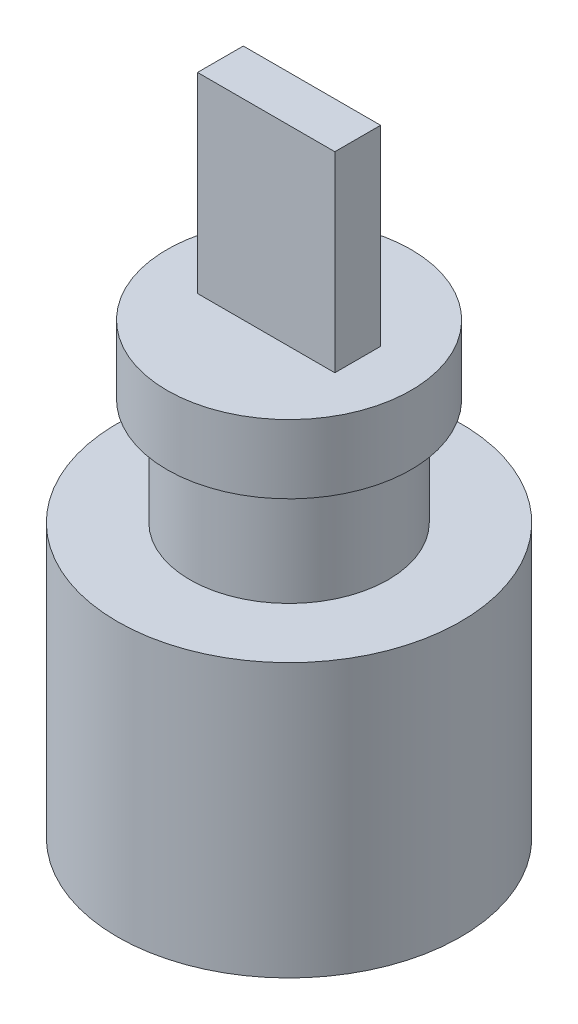
ISO-10303-21;
HEADER;
FILE_DESCRIPTION(('STEP AP214'),'2;1');
FILE_NAME('part.step','',(''),(''),'','','');
FILE_SCHEMA(('AUTOMOTIVE_DESIGN { 1 0 10303 214 1 1 1 1 }'));
ENDSEC;
DATA;
#1=APPLICATION_CONTEXT('core data for automotive mechanical design processes');
#2=APPLICATION_PROTOCOL_DEFINITION('international standard','automotive_design',2000,#1);
#3=PRODUCT_CONTEXT('',#1,'mechanical');
#4=PRODUCT('Part','Part','',(#3));
#5=PRODUCT_RELATED_PRODUCT_CATEGORY('part','',(#4));
#6=PRODUCT_DEFINITION_FORMATION('','',#4);
#7=PRODUCT_DEFINITION_CONTEXT('part definition',#1,'design');
#8=PRODUCT_DEFINITION('design','',#6,#7);
#9=PRODUCT_DEFINITION_SHAPE('','',#8);
#10=(LENGTH_UNIT() NAMED_UNIT(*) SI_UNIT(.MILLI.,.METRE.));
#11=(NAMED_UNIT(*) PLANE_ANGLE_UNIT() SI_UNIT($,.RADIAN.));
#12=(NAMED_UNIT(*) SI_UNIT($,.STERADIAN.) SOLID_ANGLE_UNIT());
#13=UNCERTAINTY_MEASURE_WITH_UNIT(LENGTH_MEASURE(1.E-05),#10,'distance_accuracy_value','');
#14=(GEOMETRIC_REPRESENTATION_CONTEXT(3) GLOBAL_UNCERTAINTY_ASSIGNED_CONTEXT((#13)) GLOBAL_UNIT_ASSIGNED_CONTEXT((#10,
#11,#12)) REPRESENTATION_CONTEXT('',''));
#15=CARTESIAN_POINT('',(0.,0.,0.));
#16=DIRECTION('',(0.,0.,1.));
#17=DIRECTION('',(1.,0.,0.));
#18=AXIS2_PLACEMENT_3D('',#15,#16,#17);
#19=CARTESIAN_POINT('',(0.,35.8,0.));
#20=DIRECTION('',(0.,-1.,0.));
#21=DIRECTION('',(0.,0.,-1.));
#22=AXIS2_PLACEMENT_3D('',#19,#20,#21);
#23=CYLINDRICAL_SURFACE('',#22,22.5);
#24=CARTESIAN_POINT('',(0.,35.8,0.));
#25=DIRECTION('',(0.,1.,0.));
#26=DIRECTION('',(0.,0.,1.));
#27=AXIS2_PLACEMENT_3D('',#24,#25,#26);
#28=CIRCLE('',#27,22.5);
#29=CARTESIAN_POINT('',(0.,35.8,22.5));
#30=VERTEX_POINT('',#29);
#31=EDGE_CURVE('E43',#30,#30,#28,.T.);
#32=ORIENTED_EDGE('',*,*,#31,.F.);
#33=EDGE_LOOP('',(#32));
#34=FACE_BOUND('',#33,.T.);
#35=CARTESIAN_POINT('',(0.,0.,0.));
#36=DIRECTION('',(0.,1.,0.));
#37=DIRECTION('',(0.,0.,1.));
#38=AXIS2_PLACEMENT_3D('',#35,#36,#37);
#39=CIRCLE('',#38,22.5);
#40=CARTESIAN_POINT('',(0.,0.,22.5));
#41=VERTEX_POINT('',#40);
#42=EDGE_CURVE('E38',#41,#41,#39,.T.);
#43=ORIENTED_EDGE('',*,*,#42,.T.);
#44=EDGE_LOOP('',(#43));
#45=FACE_BOUND('',#44,.T.);
#46=ADVANCED_FACE('F35',(#34,#45),#23,.T.);
#47=CARTESIAN_POINT('',(0.,35.8,0.));
#48=DIRECTION('',(0.,1.,0.));
#49=DIRECTION('',(0.,0.,1.));
#50=AXIS2_PLACEMENT_3D('',#47,#48,#49);
#51=PLANE('',#50);
#52=CARTESIAN_POINT('',(0.,35.8,0.));
#53=DIRECTION('',(0.,1.,0.));
#54=DIRECTION('',(0.,0.,1.));
#55=AXIS2_PLACEMENT_3D('',#52,#53,#54);
#56=CIRCLE('',#55,13.);
#57=CARTESIAN_POINT('',(0.,35.8,13.));
#58=VERTEX_POINT('',#57);
#59=EDGE_CURVE('E11',#58,#58,#56,.T.);
#60=ORIENTED_EDGE('',*,*,#59,.F.);
#61=EDGE_LOOP('',(#60));
#62=FACE_BOUND('',#61,.T.);
#63=ORIENTED_EDGE('',*,*,#31,.T.);
#64=EDGE_LOOP('',(#63));
#65=FACE_BOUND('',#64,.T.);
#66=ADVANCED_FACE('F120',(#62,#65),#51,.T.);
#67=CARTESIAN_POINT('',(0.,0.,0.));
#68=DIRECTION('',(0.,1.,0.));
#69=DIRECTION('',(0.,0.,1.));
#70=AXIS2_PLACEMENT_3D('',#67,#68,#69);
#71=PLANE('',#70);
#72=ORIENTED_EDGE('',*,*,#42,.F.);
#73=EDGE_LOOP('',(#72));
#74=FACE_BOUND('',#73,.T.);
#75=ADVANCED_FACE('F117',(#74),#71,.F.);
#76=CARTESIAN_POINT('',(0.,49.8,0.));
#77=DIRECTION('',(0.,-1.,0.));
#78=DIRECTION('',(0.,0.,-1.));
#79=AXIS2_PLACEMENT_3D('',#76,#77,#78);
#80=CYLINDRICAL_SURFACE('',#79,13.);
#81=CARTESIAN_POINT('',(0.,49.8,0.));
#82=DIRECTION('',(0.,1.,0.));
#83=DIRECTION('',(0.,0.,1.));
#84=AXIS2_PLACEMENT_3D('',#81,#82,#83);
#85=CIRCLE('',#84,13.);
#86=CARTESIAN_POINT('',(0.,49.8,13.));
#87=VERTEX_POINT('',#86);
#88=EDGE_CURVE('E107',#87,#87,#85,.T.);
#89=ORIENTED_EDGE('',*,*,#88,.F.);
#90=EDGE_LOOP('',(#89));
#91=FACE_BOUND('',#90,.T.);
#92=ORIENTED_EDGE('',*,*,#59,.T.);
#93=EDGE_LOOP('',(#92));
#94=FACE_BOUND('',#93,.T.);
#95=ADVANCED_FACE('F119',(#91,#94),#80,.T.);
#96=CARTESIAN_POINT('',(0.,58.8,0.));
#97=DIRECTION('',(0.,-1.,0.));
#98=DIRECTION('',(0.,0.,-1.));
#99=AXIS2_PLACEMENT_3D('',#96,#97,#98);
#100=CYLINDRICAL_SURFACE('',#99,16.);
#101=CARTESIAN_POINT('',(0.,58.8,0.));
#102=DIRECTION('',(0.,1.,0.));
#103=DIRECTION('',(0.,0.,1.));
#104=AXIS2_PLACEMENT_3D('',#101,#102,#103);
#105=CIRCLE('',#104,16.);
#106=CARTESIAN_POINT('',(0.,58.8,16.));
#107=VERTEX_POINT('',#106);
#108=EDGE_CURVE('E100',#107,#107,#105,.T.);
#109=ORIENTED_EDGE('',*,*,#108,.F.);
#110=EDGE_LOOP('',(#109));
#111=FACE_BOUND('',#110,.T.);
#112=CARTESIAN_POINT('',(0.,49.8,0.));
#113=DIRECTION('',(0.,1.,0.));
#114=DIRECTION('',(0.,0.,1.));
#115=AXIS2_PLACEMENT_3D('',#112,#113,#114);
#116=CIRCLE('',#115,16.);
#117=CARTESIAN_POINT('',(0.,49.8,16.));
#118=VERTEX_POINT('',#117);
#119=EDGE_CURVE('E97',#118,#118,#116,.T.);
#120=ORIENTED_EDGE('',*,*,#119,.T.);
#121=EDGE_LOOP('',(#120));
#122=FACE_BOUND('',#121,.T.);
#123=ADVANCED_FACE('F125',(#111,#122),#100,.T.);
#124=CARTESIAN_POINT('',(0.,58.8,0.));
#125=DIRECTION('',(0.,1.,0.));
#126=DIRECTION('',(0.,0.,1.));
#127=AXIS2_PLACEMENT_3D('',#124,#125,#126);
#128=PLANE('',#127);
#129=DIRECTION('',(0.,0.,-1.));
#130=VECTOR('',#129,1.);
#131=CARTESIAN_POINT('',(9.,58.8,-3.));
#132=LINE('',#131,#130);
#133=CARTESIAN_POINT('',(9.,58.8,3.));
#134=VERTEX_POINT('',#133);
#135=CARTESIAN_POINT('',(9.,58.8,-3.));
#136=VERTEX_POINT('',#135);
#137=EDGE_CURVE('E51',#134,#136,#132,.T.);
#138=ORIENTED_EDGE('',*,*,#137,.F.);
#139=DIRECTION('',(1.,0.,0.));
#140=VECTOR('',#139,1.);
#141=CARTESIAN_POINT('',(-9.,58.8,3.));
#142=LINE('',#141,#140);
#143=CARTESIAN_POINT('',(-9.,58.8,3.));
#144=VERTEX_POINT('',#143);
#145=EDGE_CURVE('E55',#144,#134,#142,.T.);
#146=ORIENTED_EDGE('',*,*,#145,.F.);
#147=DIRECTION('',(0.,0.,1.));
#148=VECTOR('',#147,1.);
#149=CARTESIAN_POINT('',(-9.,58.8,-3.));
#150=LINE('',#149,#148);
#151=CARTESIAN_POINT('',(-9.,58.8,-3.));
#152=VERTEX_POINT('',#151);
#153=EDGE_CURVE('E225',#152,#144,#150,.T.);
#154=ORIENTED_EDGE('',*,*,#153,.F.);
#155=DIRECTION('',(-1.,0.,0.));
#156=VECTOR('',#155,1.);
#157=CARTESIAN_POINT('',(-9.,58.8,-3.));
#158=LINE('',#157,#156);
#159=EDGE_CURVE('E231',#136,#152,#158,.T.);
#160=ORIENTED_EDGE('',*,*,#159,.F.);
#161=EDGE_LOOP('',(#138,#146,#154,#160));
#162=FACE_BOUND('',#161,.T.);
#163=ORIENTED_EDGE('',*,*,#108,.T.);
#164=EDGE_LOOP('',(#163));
#165=FACE_BOUND('',#164,.T.);
#166=ADVANCED_FACE('F155',(#162,#165),#128,.T.);
#167=CARTESIAN_POINT('',(0.,49.8,0.));
#168=DIRECTION('',(0.,1.,0.));
#169=DIRECTION('',(0.,0.,1.));
#170=AXIS2_PLACEMENT_3D('',#167,#168,#169);
#171=PLANE('',#170);
#172=ORIENTED_EDGE('',*,*,#88,.T.);
#173=EDGE_LOOP('',(#172));
#174=FACE_BOUND('',#173,.T.);
#175=ORIENTED_EDGE('',*,*,#119,.F.);
#176=EDGE_LOOP('',(#175));
#177=FACE_BOUND('',#176,.T.);
#178=ADVANCED_FACE('F163',(#174,#177),#171,.F.);
#179=CARTESIAN_POINT('',(9.,83.9,-3.));
#180=DIRECTION('',(-1.,0.,0.));
#181=DIRECTION('',(0.,0.,1.));
#182=AXIS2_PLACEMENT_3D('',#179,#180,#181);
#183=PLANE('',#182);
#184=ORIENTED_EDGE('',*,*,#137,.T.);
#185=DIRECTION('',(0.,-1.,0.));
#186=VECTOR('',#185,1.);
#187=CARTESIAN_POINT('',(9.,83.9,-3.));
#188=LINE('',#187,#186);
#189=CARTESIAN_POINT('',(9.,83.9,-3.));
#190=VERTEX_POINT('',#189);
#191=EDGE_CURVE('E80',#190,#136,#188,.T.);
#192=ORIENTED_EDGE('',*,*,#191,.F.);
#193=DIRECTION('',(0.,0.,-1.));
#194=VECTOR('',#193,1.);
#195=CARTESIAN_POINT('',(9.,83.9,-3.));
#196=LINE('',#195,#194);
#197=CARTESIAN_POINT('',(9.,83.9,3.));
#198=VERTEX_POINT('',#197);
#199=EDGE_CURVE('E86',#198,#190,#196,.T.);
#200=ORIENTED_EDGE('',*,*,#199,.F.);
#201=DIRECTION('',(0.,-1.,0.));
#202=VECTOR('',#201,1.);
#203=CARTESIAN_POINT('',(9.,83.9,3.));
#204=LINE('',#203,#202);
#205=EDGE_CURVE('E223',#198,#134,#204,.T.);
#206=ORIENTED_EDGE('',*,*,#205,.T.);
#207=EDGE_LOOP('',(#184,#192,#200,#206));
#208=FACE_BOUND('',#207,.T.);
#209=ADVANCED_FACE('F96',(#208),#183,.F.);
#210=CARTESIAN_POINT('',(-9.,83.9,-3.));
#211=DIRECTION('',(0.,0.,1.));
#212=DIRECTION('',(1.,0.,0.));
#213=AXIS2_PLACEMENT_3D('',#210,#211,#212);
#214=PLANE('',#213);
#215=ORIENTED_EDGE('',*,*,#159,.T.);
#216=DIRECTION('',(0.,-1.,0.));
#217=VECTOR('',#216,1.);
#218=CARTESIAN_POINT('',(-9.,83.9,-3.));
#219=LINE('',#218,#217);
#220=CARTESIAN_POINT('',(-9.,83.9,-3.));
#221=VERTEX_POINT('',#220);
#222=EDGE_CURVE('E82',#221,#152,#219,.T.);
#223=ORIENTED_EDGE('',*,*,#222,.F.);
#224=DIRECTION('',(-1.,0.,0.));
#225=VECTOR('',#224,1.);
#226=CARTESIAN_POINT('',(-9.,83.9,-3.));
#227=LINE('',#226,#225);
#228=EDGE_CURVE('E75',#190,#221,#227,.T.);
#229=ORIENTED_EDGE('',*,*,#228,.F.);
#230=ORIENTED_EDGE('',*,*,#191,.T.);
#231=EDGE_LOOP('',(#215,#223,#229,#230));
#232=FACE_BOUND('',#231,.T.);
#233=ADVANCED_FACE('F78',(#232),#214,.F.);
#234=CARTESIAN_POINT('',(-9.,83.9,-3.));
#235=DIRECTION('',(1.,0.,0.));
#236=DIRECTION('',(0.,0.,-1.));
#237=AXIS2_PLACEMENT_3D('',#234,#235,#236);
#238=PLANE('',#237);
#239=ORIENTED_EDGE('',*,*,#153,.T.);
#240=DIRECTION('',(0.,-1.,0.));
#241=VECTOR('',#240,1.);
#242=CARTESIAN_POINT('',(-9.,83.9,3.));
#243=LINE('',#242,#241);
#244=CARTESIAN_POINT('',(-9.,83.9,3.));
#245=VERTEX_POINT('',#244);
#246=EDGE_CURVE('E102',#245,#144,#243,.T.);
#247=ORIENTED_EDGE('',*,*,#246,.F.);
#248=DIRECTION('',(0.,0.,1.));
#249=VECTOR('',#248,1.);
#250=CARTESIAN_POINT('',(-9.,83.9,-3.));
#251=LINE('',#250,#249);
#252=EDGE_CURVE('E85',#221,#245,#251,.T.);
#253=ORIENTED_EDGE('',*,*,#252,.F.);
#254=ORIENTED_EDGE('',*,*,#222,.T.);
#255=EDGE_LOOP('',(#239,#247,#253,#254));
#256=FACE_BOUND('',#255,.T.);
#257=ADVANCED_FACE('F191',(#256),#238,.F.);
#258=CARTESIAN_POINT('',(-9.,83.9,3.));
#259=DIRECTION('',(0.,0.,-1.));
#260=DIRECTION('',(-1.,0.,0.));
#261=AXIS2_PLACEMENT_3D('',#258,#259,#260);
#262=PLANE('',#261);
#263=ORIENTED_EDGE('',*,*,#145,.T.);
#264=ORIENTED_EDGE('',*,*,#205,.F.);
#265=DIRECTION('',(1.,0.,0.));
#266=VECTOR('',#265,1.);
#267=CARTESIAN_POINT('',(-9.,83.9,3.));
#268=LINE('',#267,#266);
#269=EDGE_CURVE('E91',#245,#198,#268,.T.);
#270=ORIENTED_EDGE('',*,*,#269,.F.);
#271=ORIENTED_EDGE('',*,*,#246,.T.);
#272=EDGE_LOOP('',(#263,#264,#270,#271));
#273=FACE_BOUND('',#272,.T.);
#274=ADVANCED_FACE('F200',(#273),#262,.F.);
#275=CARTESIAN_POINT('',(0.,83.9,0.));
#276=DIRECTION('',(0.,1.,0.));
#277=DIRECTION('',(0.,0.,1.));
#278=AXIS2_PLACEMENT_3D('',#275,#276,#277);
#279=PLANE('',#278);
#280=ORIENTED_EDGE('',*,*,#199,.T.);
#281=ORIENTED_EDGE('',*,*,#228,.T.);
#282=ORIENTED_EDGE('',*,*,#252,.T.);
#283=ORIENTED_EDGE('',*,*,#269,.T.);
#284=EDGE_LOOP('',(#280,#281,#282,#283));
#285=FACE_BOUND('',#284,.T.);
#286=ADVANCED_FACE('F89',(#285),#279,.T.);
#287=CLOSED_SHELL('',(#46,#66,#75,#95,#123,#166,#178,#209,#233,#257,#274,#286));
#288=MANIFOLD_SOLID_BREP('B2',#287);
#289=ADVANCED_BREP_SHAPE_REPRESENTATION('',(#18,#288),#14);
#290=SHAPE_DEFINITION_REPRESENTATION(#9,#289);
ENDSEC;
END-ISO-10303-21;
